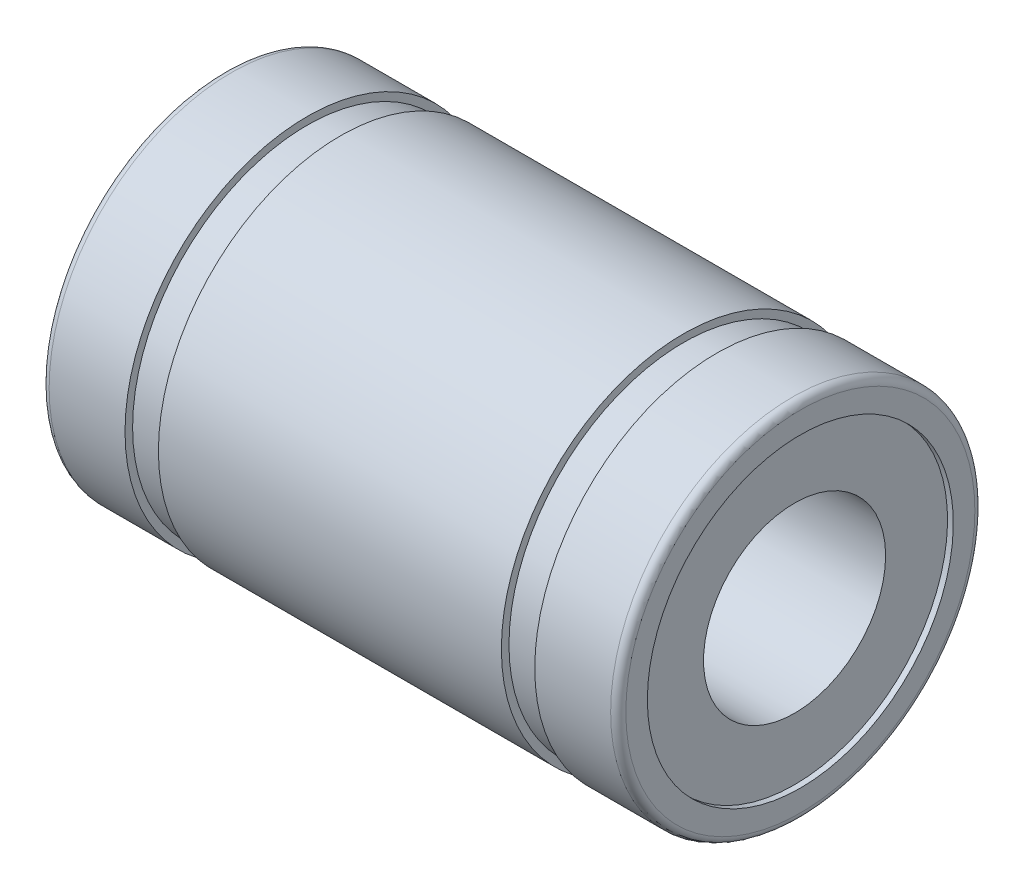
ISO-10303-21;
HEADER;
FILE_DESCRIPTION(('STEP AP214'),'2;1');
FILE_NAME('part.step','',(''),(''),'','','');
FILE_SCHEMA(('AUTOMOTIVE_DESIGN { 1 0 10303 214 1 1 1 1 }'));
ENDSEC;
DATA;
#1=APPLICATION_CONTEXT('core data for automotive mechanical design processes');
#2=APPLICATION_PROTOCOL_DEFINITION('international standard','automotive_design',2000,#1);
#3=PRODUCT_CONTEXT('',#1,'mechanical');
#4=PRODUCT('Part','Part','',(#3));
#5=PRODUCT_RELATED_PRODUCT_CATEGORY('part','',(#4));
#6=PRODUCT_DEFINITION_FORMATION('','',#4);
#7=PRODUCT_DEFINITION_CONTEXT('part definition',#1,'design');
#8=PRODUCT_DEFINITION('design','',#6,#7);
#9=PRODUCT_DEFINITION_SHAPE('','',#8);
#10=(LENGTH_UNIT() NAMED_UNIT(*) SI_UNIT(.MILLI.,.METRE.));
#11=(NAMED_UNIT(*) PLANE_ANGLE_UNIT() SI_UNIT($,.RADIAN.));
#12=(NAMED_UNIT(*) SI_UNIT($,.STERADIAN.) SOLID_ANGLE_UNIT());
#13=UNCERTAINTY_MEASURE_WITH_UNIT(LENGTH_MEASURE(1.E-05),#10,'distance_accuracy_value','');
#14=(GEOMETRIC_REPRESENTATION_CONTEXT(3) GLOBAL_UNCERTAINTY_ASSIGNED_CONTEXT((#13)) GLOBAL_UNIT_ASSIGNED_CONTEXT((#10,
#11,#12)) REPRESENTATION_CONTEXT('',''));
#15=CARTESIAN_POINT('',(0.,0.,0.));
#16=DIRECTION('',(0.,0.,1.));
#17=DIRECTION('',(1.,0.,0.));
#18=AXIS2_PLACEMENT_3D('',#15,#16,#17);
#19=CARTESIAN_POINT('',(-9.25,0.,0.));
#20=DIRECTION('',(-1.,0.,0.));
#21=DIRECTION('',(0.,0.,1.));
#22=AXIS2_PLACEMENT_3D('',#19,#20,#21);
#23=TOROIDAL_SURFACE('',#22,5.75,0.25);
#24=CARTESIAN_POINT('',(-9.5,0.,0.));
#25=DIRECTION('',(-1.,0.,0.));
#26=DIRECTION('',(0.,0.,1.));
#27=AXIS2_PLACEMENT_3D('',#24,#25,#26);
#28=CIRCLE('',#27,5.75);
#29=CARTESIAN_POINT('',(-9.5,0.,5.75));
#30=VERTEX_POINT('',#29);
#31=EDGE_CURVE('E10',#30,#30,#28,.T.);
#32=ORIENTED_EDGE('',*,*,#31,.F.);
#33=EDGE_LOOP('',(#32));
#34=FACE_BOUND('',#33,.T.);
#35=CARTESIAN_POINT('',(-9.25,0.,0.));
#36=DIRECTION('',(-1.,0.,0.));
#37=DIRECTION('',(0.,0.,1.));
#38=AXIS2_PLACEMENT_3D('',#35,#36,#37);
#39=CIRCLE('',#38,6.);
#40=CARTESIAN_POINT('',(-9.25,0.,6.));
#41=VERTEX_POINT('',#40);
#42=EDGE_CURVE('E39',#41,#41,#39,.T.);
#43=ORIENTED_EDGE('',*,*,#42,.T.);
#44=EDGE_LOOP('',(#43));
#45=FACE_BOUND('',#44,.T.);
#46=ADVANCED_FACE('F14',(#34,#45),#23,.T.);
#47=CARTESIAN_POINT('',(-9.5,5.75,0.));
#48=DIRECTION('',(1.,0.,0.));
#49=DIRECTION('',(0.,0.,-1.));
#50=AXIS2_PLACEMENT_3D('',#47,#48,#49);
#51=PLANE('',#50);
#52=CARTESIAN_POINT('',(-9.5,0.,0.));
#53=DIRECTION('',(1.,0.,0.));
#54=DIRECTION('',(0.,0.,-1.));
#55=AXIS2_PLACEMENT_3D('',#52,#53,#54);
#56=CIRCLE('',#55,5.04);
#57=CARTESIAN_POINT('',(-9.5,0.,-5.04));
#58=VERTEX_POINT('',#57);
#59=EDGE_CURVE('E40',#58,#58,#56,.T.);
#60=ORIENTED_EDGE('',*,*,#59,.T.);
#61=EDGE_LOOP('',(#60));
#62=FACE_BOUND('',#61,.T.);
#63=ORIENTED_EDGE('',*,*,#31,.T.);
#64=EDGE_LOOP('',(#63));
#65=FACE_BOUND('',#64,.T.);
#66=ADVANCED_FACE('F108',(#62,#65),#51,.F.);
#67=CARTESIAN_POINT('',(9.5,0.,0.));
#68=DIRECTION('',(-1.,0.,0.));
#69=DIRECTION('',(0.,0.,1.));
#70=AXIS2_PLACEMENT_3D('',#67,#68,#69);
#71=PLANE('',#70);
#72=CARTESIAN_POINT('',(9.5,0.,0.));
#73=DIRECTION('',(-1.,0.,0.));
#74=DIRECTION('',(0.,0.,1.));
#75=AXIS2_PLACEMENT_3D('',#72,#73,#74);
#76=CIRCLE('',#75,5.04);
#77=CARTESIAN_POINT('',(9.5,0.,5.04));
#78=VERTEX_POINT('',#77);
#79=EDGE_CURVE('E36',#78,#78,#76,.T.);
#80=ORIENTED_EDGE('',*,*,#79,.T.);
#81=EDGE_LOOP('',(#80));
#82=FACE_BOUND('',#81,.T.);
#83=CARTESIAN_POINT('',(9.5,0.,0.));
#84=DIRECTION('',(-1.,0.,0.));
#85=DIRECTION('',(0.,0.,1.));
#86=AXIS2_PLACEMENT_3D('',#83,#84,#85);
#87=CIRCLE('',#86,5.75);
#88=CARTESIAN_POINT('',(9.5,0.,5.75));
#89=VERTEX_POINT('',#88);
#90=EDGE_CURVE('E22',#89,#89,#87,.T.);
#91=ORIENTED_EDGE('',*,*,#90,.F.);
#92=EDGE_LOOP('',(#91));
#93=FACE_BOUND('',#92,.T.);
#94=ADVANCED_FACE('F103',(#82,#93),#71,.F.);
#95=CARTESIAN_POINT('',(9.25,0.,0.));
#96=DIRECTION('',(-1.,0.,0.));
#97=DIRECTION('',(0.,0.,1.));
#98=AXIS2_PLACEMENT_3D('',#95,#96,#97);
#99=TOROIDAL_SURFACE('',#98,5.75,0.25);
#100=CARTESIAN_POINT('',(9.25,0.,0.));
#101=DIRECTION('',(-1.,0.,0.));
#102=DIRECTION('',(0.,0.,1.));
#103=AXIS2_PLACEMENT_3D('',#100,#101,#102);
#104=CIRCLE('',#103,6.);
#105=CARTESIAN_POINT('',(9.25,0.,6.));
#106=VERTEX_POINT('',#105);
#107=EDGE_CURVE('E32',#106,#106,#104,.T.);
#108=ORIENTED_EDGE('',*,*,#107,.F.);
#109=EDGE_LOOP('',(#108));
#110=FACE_BOUND('',#109,.T.);
#111=ORIENTED_EDGE('',*,*,#90,.T.);
#112=EDGE_LOOP('',(#111));
#113=FACE_BOUND('',#112,.T.);
#114=ADVANCED_FACE('F100',(#110,#113),#99,.T.);
#115=CARTESIAN_POINT('',(0.,0.,0.));
#116=DIRECTION('',(-1.,0.,0.));
#117=DIRECTION('',(0.,0.,1.));
#118=AXIS2_PLACEMENT_3D('',#115,#116,#117);
#119=CYLINDRICAL_SURFACE('',#118,6.);
#120=CARTESIAN_POINT('',(6.75,0.,0.));
#121=DIRECTION('',(-1.,0.,0.));
#122=DIRECTION('',(0.,0.,1.));
#123=AXIS2_PLACEMENT_3D('',#120,#121,#122);
#124=CIRCLE('',#123,6.);
#125=CARTESIAN_POINT('',(6.75,0.,6.));
#126=VERTEX_POINT('',#125);
#127=EDGE_CURVE('E90',#126,#126,#124,.T.);
#128=ORIENTED_EDGE('',*,*,#127,.F.);
#129=EDGE_LOOP('',(#128));
#130=FACE_BOUND('',#129,.T.);
#131=ORIENTED_EDGE('',*,*,#107,.T.);
#132=EDGE_LOOP('',(#131));
#133=FACE_BOUND('',#132,.T.);
#134=ADVANCED_FACE('F98',(#130,#133),#119,.T.);
#135=CARTESIAN_POINT('',(6.75,5.75,0.));
#136=DIRECTION('',(-1.,0.,0.));
#137=DIRECTION('',(0.,0.,1.));
#138=AXIS2_PLACEMENT_3D('',#135,#136,#137);
#139=PLANE('',#138);
#140=ORIENTED_EDGE('',*,*,#127,.T.);
#141=EDGE_LOOP('',(#140));
#142=FACE_BOUND('',#141,.T.);
#143=CARTESIAN_POINT('',(6.75,0.,0.));
#144=DIRECTION('',(-1.,0.,0.));
#145=DIRECTION('',(0.,0.,1.));
#146=AXIS2_PLACEMENT_3D('',#143,#144,#145);
#147=CIRCLE('',#146,5.75);
#148=CARTESIAN_POINT('',(6.75,0.,5.75));
#149=VERTEX_POINT('',#148);
#150=EDGE_CURVE('E86',#149,#149,#147,.T.);
#151=ORIENTED_EDGE('',*,*,#150,.F.);
#152=EDGE_LOOP('',(#151));
#153=FACE_BOUND('',#152,.T.);
#154=ADVANCED_FACE('F156',(#142,#153),#139,.T.);
#155=CARTESIAN_POINT('',(0.,0.,0.));
#156=DIRECTION('',(-1.,0.,0.));
#157=DIRECTION('',(0.,0.,1.));
#158=AXIS2_PLACEMENT_3D('',#155,#156,#157);
#159=CYLINDRICAL_SURFACE('',#158,5.75);
#160=ORIENTED_EDGE('',*,*,#150,.T.);
#161=EDGE_LOOP('',(#160));
#162=FACE_BOUND('',#161,.T.);
#163=CARTESIAN_POINT('',(5.65,0.,0.));
#164=DIRECTION('',(-1.,0.,0.));
#165=DIRECTION('',(0.,0.,1.));
#166=AXIS2_PLACEMENT_3D('',#163,#164,#165);
#167=CIRCLE('',#166,5.75);
#168=CARTESIAN_POINT('',(5.65,0.,5.75));
#169=VERTEX_POINT('',#168);
#170=EDGE_CURVE('E82',#169,#169,#167,.T.);
#171=ORIENTED_EDGE('',*,*,#170,.F.);
#172=EDGE_LOOP('',(#171));
#173=FACE_BOUND('',#172,.T.);
#174=ADVANCED_FACE('F152',(#162,#173),#159,.T.);
#175=CARTESIAN_POINT('',(5.65,6.,0.));
#176=DIRECTION('',(1.,0.,0.));
#177=DIRECTION('',(0.,0.,-1.));
#178=AXIS2_PLACEMENT_3D('',#175,#176,#177);
#179=PLANE('',#178);
#180=ORIENTED_EDGE('',*,*,#170,.T.);
#181=EDGE_LOOP('',(#180));
#182=FACE_BOUND('',#181,.T.);
#183=CARTESIAN_POINT('',(5.65,0.,0.));
#184=DIRECTION('',(-1.,0.,0.));
#185=DIRECTION('',(0.,0.,1.));
#186=AXIS2_PLACEMENT_3D('',#183,#184,#185);
#187=CIRCLE('',#186,6.);
#188=CARTESIAN_POINT('',(5.65,0.,6.));
#189=VERTEX_POINT('',#188);
#190=EDGE_CURVE('E78',#189,#189,#187,.T.);
#191=ORIENTED_EDGE('',*,*,#190,.F.);
#192=EDGE_LOOP('',(#191));
#193=FACE_BOUND('',#192,.T.);
#194=ADVANCED_FACE('F148',(#182,#193),#179,.T.);
#195=CARTESIAN_POINT('',(0.,0.,0.));
#196=DIRECTION('',(-1.,0.,0.));
#197=DIRECTION('',(0.,0.,1.));
#198=AXIS2_PLACEMENT_3D('',#195,#196,#197);
#199=CYLINDRICAL_SURFACE('',#198,6.);
#200=CARTESIAN_POINT('',(-5.65,0.,0.));
#201=DIRECTION('',(-1.,0.,0.));
#202=DIRECTION('',(0.,0.,1.));
#203=AXIS2_PLACEMENT_3D('',#200,#201,#202);
#204=CIRCLE('',#203,6.);
#205=CARTESIAN_POINT('',(-5.65,0.,6.));
#206=VERTEX_POINT('',#205);
#207=EDGE_CURVE('E74',#206,#206,#204,.T.);
#208=ORIENTED_EDGE('',*,*,#207,.F.);
#209=EDGE_LOOP('',(#208));
#210=FACE_BOUND('',#209,.T.);
#211=ORIENTED_EDGE('',*,*,#190,.T.);
#212=EDGE_LOOP('',(#211));
#213=FACE_BOUND('',#212,.T.);
#214=ADVANCED_FACE('F144',(#210,#213),#199,.T.);
#215=CARTESIAN_POINT('',(-5.65,5.75,0.));
#216=DIRECTION('',(-1.,0.,0.));
#217=DIRECTION('',(0.,0.,1.));
#218=AXIS2_PLACEMENT_3D('',#215,#216,#217);
#219=PLANE('',#218);
#220=ORIENTED_EDGE('',*,*,#207,.T.);
#221=EDGE_LOOP('',(#220));
#222=FACE_BOUND('',#221,.T.);
#223=CARTESIAN_POINT('',(-5.65,0.,0.));
#224=DIRECTION('',(-1.,0.,0.));
#225=DIRECTION('',(0.,0.,1.));
#226=AXIS2_PLACEMENT_3D('',#223,#224,#225);
#227=CIRCLE('',#226,5.75);
#228=CARTESIAN_POINT('',(-5.65,0.,5.75));
#229=VERTEX_POINT('',#228);
#230=EDGE_CURVE('E70',#229,#229,#227,.T.);
#231=ORIENTED_EDGE('',*,*,#230,.F.);
#232=EDGE_LOOP('',(#231));
#233=FACE_BOUND('',#232,.T.);
#234=ADVANCED_FACE('F137',(#222,#233),#219,.T.);
#235=CARTESIAN_POINT('',(0.,0.,0.));
#236=DIRECTION('',(-1.,0.,0.));
#237=DIRECTION('',(0.,0.,1.));
#238=AXIS2_PLACEMENT_3D('',#235,#236,#237);
#239=CYLINDRICAL_SURFACE('',#238,5.75);
#240=ORIENTED_EDGE('',*,*,#230,.T.);
#241=EDGE_LOOP('',(#240));
#242=FACE_BOUND('',#241,.T.);
#243=CARTESIAN_POINT('',(-6.75,0.,0.));
#244=DIRECTION('',(-1.,0.,0.));
#245=DIRECTION('',(0.,0.,1.));
#246=AXIS2_PLACEMENT_3D('',#243,#244,#245);
#247=CIRCLE('',#246,5.75);
#248=CARTESIAN_POINT('',(-6.75,0.,5.75));
#249=VERTEX_POINT('',#248);
#250=EDGE_CURVE('E66',#249,#249,#247,.T.);
#251=ORIENTED_EDGE('',*,*,#250,.F.);
#252=EDGE_LOOP('',(#251));
#253=FACE_BOUND('',#252,.T.);
#254=ADVANCED_FACE('F131',(#242,#253),#239,.T.);
#255=CARTESIAN_POINT('',(-6.75,6.,0.));
#256=DIRECTION('',(1.,0.,0.));
#257=DIRECTION('',(0.,0.,-1.));
#258=AXIS2_PLACEMENT_3D('',#255,#256,#257);
#259=PLANE('',#258);
#260=ORIENTED_EDGE('',*,*,#250,.T.);
#261=EDGE_LOOP('',(#260));
#262=FACE_BOUND('',#261,.T.);
#263=CARTESIAN_POINT('',(-6.75,0.,0.));
#264=DIRECTION('',(-1.,0.,0.));
#265=DIRECTION('',(0.,0.,1.));
#266=AXIS2_PLACEMENT_3D('',#263,#264,#265);
#267=CIRCLE('',#266,6.);
#268=CARTESIAN_POINT('',(-6.75,0.,6.));
#269=VERTEX_POINT('',#268);
#270=EDGE_CURVE('E63',#269,#269,#267,.T.);
#271=ORIENTED_EDGE('',*,*,#270,.F.);
#272=EDGE_LOOP('',(#271));
#273=FACE_BOUND('',#272,.T.);
#274=ADVANCED_FACE('F126',(#262,#273),#259,.T.);
#275=CARTESIAN_POINT('',(0.,0.,0.));
#276=DIRECTION('',(-1.,0.,0.));
#277=DIRECTION('',(0.,0.,1.));
#278=AXIS2_PLACEMENT_3D('',#275,#276,#277);
#279=CYLINDRICAL_SURFACE('',#278,6.);
#280=ORIENTED_EDGE('',*,*,#42,.F.);
#281=EDGE_LOOP('',(#280));
#282=FACE_BOUND('',#281,.T.);
#283=ORIENTED_EDGE('',*,*,#270,.T.);
#284=EDGE_LOOP('',(#283));
#285=FACE_BOUND('',#284,.T.);
#286=ADVANCED_FACE('F122',(#282,#285),#279,.T.);
#287=CARTESIAN_POINT('',(8.55,0.,0.));
#288=DIRECTION('',(1.,0.,0.));
#289=DIRECTION('',(0.,-1.,0.));
#290=AXIS2_PLACEMENT_3D('',#287,#288,#289);
#291=CYLINDRICAL_SURFACE('',#290,5.04);
#292=CARTESIAN_POINT('',(9.31,0.,0.));
#293=DIRECTION('',(-1.,0.,0.));
#294=DIRECTION('',(0.,-1.,0.));
#295=AXIS2_PLACEMENT_3D('',#292,#293,#294);
#296=CIRCLE('',#295,5.04);
#297=CARTESIAN_POINT('',(9.31,-5.04,0.));
#298=VERTEX_POINT('',#297);
#299=EDGE_CURVE('E43',#298,#298,#296,.T.);
#300=ORIENTED_EDGE('',*,*,#299,.T.);
#301=EDGE_LOOP('',(#300));
#302=FACE_BOUND('',#301,.T.);
#303=ORIENTED_EDGE('',*,*,#79,.F.);
#304=EDGE_LOOP('',(#303));
#305=FACE_BOUND('',#304,.T.);
#306=ADVANCED_FACE('F125',(#302,#305),#291,.F.);
#307=CARTESIAN_POINT('',(-8.55,0.,0.));
#308=DIRECTION('',(-1.,0.,0.));
#309=DIRECTION('',(0.,-1.,0.));
#310=AXIS2_PLACEMENT_3D('',#307,#308,#309);
#311=CYLINDRICAL_SURFACE('',#310,5.04);
#312=CARTESIAN_POINT('',(-9.31,0.,0.));
#313=DIRECTION('',(1.,0.,0.));
#314=DIRECTION('',(0.,-1.,0.));
#315=AXIS2_PLACEMENT_3D('',#312,#313,#314);
#316=CIRCLE('',#315,5.04);
#317=CARTESIAN_POINT('',(-9.31,-5.04,0.));
#318=VERTEX_POINT('',#317);
#319=EDGE_CURVE('E49',#318,#318,#316,.T.);
#320=ORIENTED_EDGE('',*,*,#319,.T.);
#321=EDGE_LOOP('',(#320));
#322=FACE_BOUND('',#321,.T.);
#323=ORIENTED_EDGE('',*,*,#59,.F.);
#324=EDGE_LOOP('',(#323));
#325=FACE_BOUND('',#324,.T.);
#326=ADVANCED_FACE('F223',(#322,#325),#311,.F.);
#327=CARTESIAN_POINT('',(9.31,0.,0.));
#328=DIRECTION('',(1.,0.,0.));
#329=DIRECTION('',(0.,0.,-1.));
#330=AXIS2_PLACEMENT_3D('',#327,#328,#329);
#331=PLANE('',#330);
#332=CARTESIAN_POINT('',(9.31,0.,0.));
#333=DIRECTION('',(1.,0.,0.));
#334=DIRECTION('',(0.,0.,-1.));
#335=AXIS2_PLACEMENT_3D('',#332,#333,#334);
#336=CIRCLE('',#335,3.);
#337=CARTESIAN_POINT('',(9.31,0.,-3.));
#338=VERTEX_POINT('',#337);
#339=EDGE_CURVE('E57',#338,#338,#336,.T.);
#340=ORIENTED_EDGE('',*,*,#339,.F.);
#341=EDGE_LOOP('',(#340));
#342=FACE_BOUND('',#341,.T.);
#343=ORIENTED_EDGE('',*,*,#299,.F.);
#344=EDGE_LOOP('',(#343));
#345=FACE_BOUND('',#344,.T.);
#346=ADVANCED_FACE('F231',(#342,#345),#331,.T.);
#347=CARTESIAN_POINT('',(-9.31,0.,0.));
#348=DIRECTION('',(-1.,0.,0.));
#349=DIRECTION('',(0.,0.,1.));
#350=AXIS2_PLACEMENT_3D('',#347,#348,#349);
#351=PLANE('',#350);
#352=CARTESIAN_POINT('',(-9.31,0.,0.));
#353=DIRECTION('',(-1.,0.,0.));
#354=DIRECTION('',(0.,0.,1.));
#355=AXIS2_PLACEMENT_3D('',#352,#353,#354);
#356=CIRCLE('',#355,3.);
#357=CARTESIAN_POINT('',(-9.31,0.,3.));
#358=VERTEX_POINT('',#357);
#359=EDGE_CURVE('E17',#358,#358,#356,.T.);
#360=ORIENTED_EDGE('',*,*,#359,.F.);
#361=EDGE_LOOP('',(#360));
#362=FACE_BOUND('',#361,.T.);
#363=ORIENTED_EDGE('',*,*,#319,.F.);
#364=EDGE_LOOP('',(#363));
#365=FACE_BOUND('',#364,.T.);
#366=ADVANCED_FACE('F241',(#362,#365),#351,.T.);
#367=CARTESIAN_POINT('',(-19.,0.,0.));
#368=DIRECTION('',(1.,0.,0.));
#369=DIRECTION('',(0.,-1.,0.));
#370=AXIS2_PLACEMENT_3D('',#367,#368,#369);
#371=CYLINDRICAL_SURFACE('',#370,3.);
#372=ORIENTED_EDGE('',*,*,#339,.T.);
#373=EDGE_LOOP('',(#372));
#374=FACE_BOUND('',#373,.T.);
#375=ORIENTED_EDGE('',*,*,#359,.T.);
#376=EDGE_LOOP('',(#375));
#377=FACE_BOUND('',#376,.T.);
#378=ADVANCED_FACE('F250',(#374,#377),#371,.F.);
#379=CLOSED_SHELL('',(#46,#66,#94,#114,#134,#154,#174,#194,#214,#234,#254,#274,#286,#306,#326,
#346,#366,#378));
#380=MANIFOLD_SOLID_BREP('B1',#379);
#381=ADVANCED_BREP_SHAPE_REPRESENTATION('',(#18,#380),#14);
#382=SHAPE_DEFINITION_REPRESENTATION(#9,#381);
ENDSEC;
END-ISO-10303-21;
